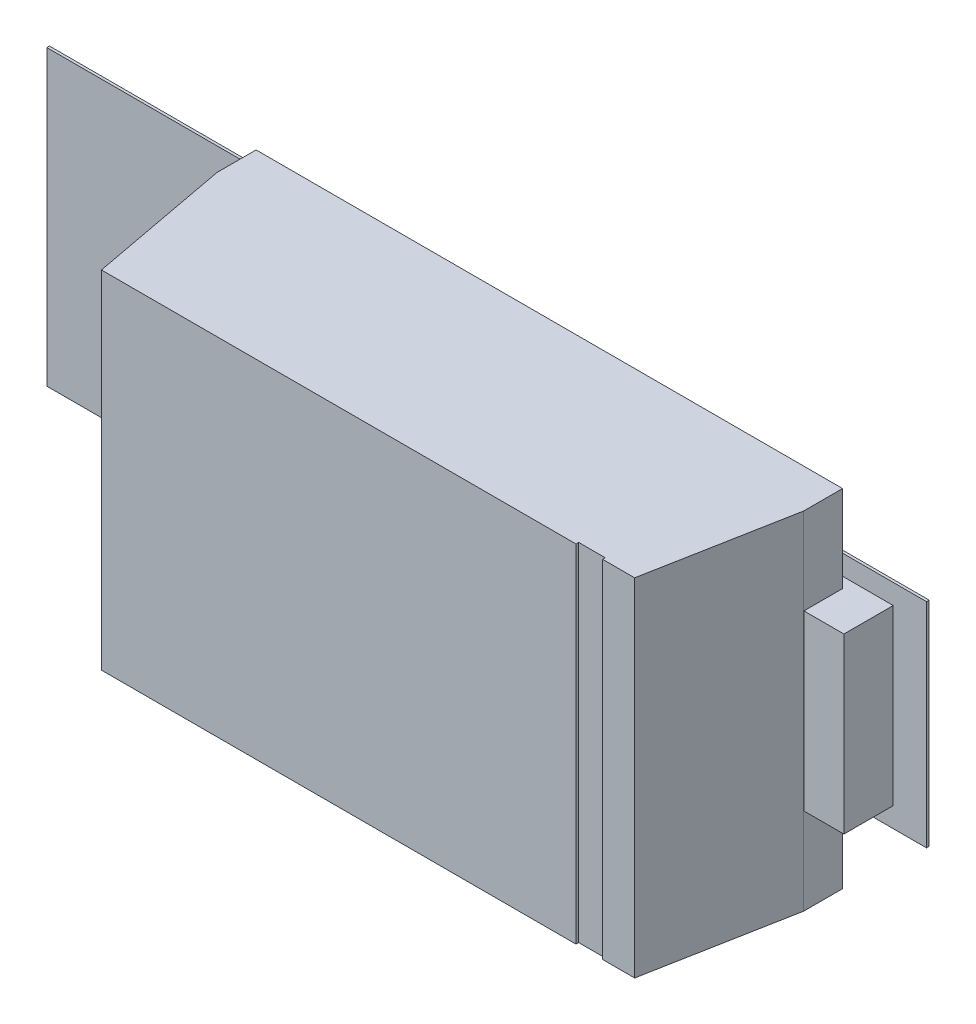
ISO-10303-21;
HEADER;
FILE_DESCRIPTION(('STEP AP214'),'2;1');
FILE_NAME('part.step','',(''),(''),'','','');
FILE_SCHEMA(('AUTOMOTIVE_DESIGN { 1 0 10303 214 1 1 1 1 }'));
ENDSEC;
DATA;
#1=APPLICATION_CONTEXT('core data for automotive mechanical design processes');
#2=APPLICATION_PROTOCOL_DEFINITION('international standard','automotive_design',2000,#1);
#3=PRODUCT_CONTEXT('',#1,'mechanical');
#4=PRODUCT('Part','Part','',(#3));
#5=PRODUCT_RELATED_PRODUCT_CATEGORY('part','',(#4));
#6=PRODUCT_DEFINITION_FORMATION('','',#4);
#7=PRODUCT_DEFINITION_CONTEXT('part definition',#1,'design');
#8=PRODUCT_DEFINITION('design','',#6,#7);
#9=PRODUCT_DEFINITION_SHAPE('','',#8);
#10=(LENGTH_UNIT() NAMED_UNIT(*) SI_UNIT(.MILLI.,.METRE.));
#11=(NAMED_UNIT(*) PLANE_ANGLE_UNIT() SI_UNIT($,.RADIAN.));
#12=(NAMED_UNIT(*) SI_UNIT($,.STERADIAN.) SOLID_ANGLE_UNIT());
#13=UNCERTAINTY_MEASURE_WITH_UNIT(LENGTH_MEASURE(1.E-05),#10,'distance_accuracy_value','');
#14=(GEOMETRIC_REPRESENTATION_CONTEXT(3) GLOBAL_UNCERTAINTY_ASSIGNED_CONTEXT((#13)) GLOBAL_UNIT_ASSIGNED_CONTEXT((#10,
#11,#12)) REPRESENTATION_CONTEXT('',''));
#15=CARTESIAN_POINT('',(0.,0.,0.));
#16=DIRECTION('',(0.,0.,1.));
#17=DIRECTION('',(1.,0.,0.));
#18=AXIS2_PLACEMENT_3D('',#15,#16,#17);
#19=CARTESIAN_POINT('',(-1.1,-0.65,0.2722));
#20=DIRECTION('',(0.982913837182173,0.,-0.184066261644595));
#21=DIRECTION('',(0.,-1.,0.));
#22=AXIS2_PLACEMENT_3D('',#19,#20,#21);
#23=PLANE('',#22);
#24=DIRECTION('',(0.,-1.,0.));
#25=VECTOR('',#24,1.);
#26=CARTESIAN_POINT('',(-1.1,0.65,0.2722));
#27=LINE('',#26,#25);
#28=CARTESIAN_POINT('',(-1.1,0.65,0.2722));
#29=VERTEX_POINT('',#28);
#30=CARTESIAN_POINT('',(-1.1,-0.65,0.2722));
#31=VERTEX_POINT('',#30);
#32=EDGE_CURVE('E440',#29,#31,#27,.T.);
#33=ORIENTED_EDGE('',*,*,#32,.T.);
#34=DIRECTION('',(0.184066261644595,0.,0.982913837182173));
#35=VECTOR('',#34,1.);
#36=CARTESIAN_POINT('',(-1.1,-0.65,0.2722));
#37=LINE('',#36,#35);
#38=CARTESIAN_POINT('',(-1.,-0.65,0.8062));
#39=VERTEX_POINT('',#38);
#40=EDGE_CURVE('E484',#31,#39,#37,.T.);
#41=ORIENTED_EDGE('',*,*,#40,.T.);
#42=DIRECTION('',(0.,1.,0.));
#43=VECTOR('',#42,1.);
#44=CARTESIAN_POINT('',(-1.,-0.65,0.8062));
#45=LINE('',#44,#43);
#46=CARTESIAN_POINT('',(-1.,0.65,0.8062));
#47=VERTEX_POINT('',#46);
#48=EDGE_CURVE('E327',#39,#47,#45,.T.);
#49=ORIENTED_EDGE('',*,*,#48,.T.);
#50=DIRECTION('',(0.184066261644595,0.,0.982913837182173));
#51=VECTOR('',#50,1.);
#52=CARTESIAN_POINT('',(-1.1,0.65,0.2722));
#53=LINE('',#52,#51);
#54=EDGE_CURVE('E322',#29,#47,#53,.T.);
#55=ORIENTED_EDGE('',*,*,#54,.F.);
#56=EDGE_LOOP('',(#33,#41,#49,#55));
#57=FACE_BOUND('',#56,.T.);
#58=ADVANCED_FACE('F17',(#57),#23,.F.);
#59=CARTESIAN_POINT('',(1.25,-0.325,0.0762));
#60=DIRECTION('',(1.,0.,0.));
#61=DIRECTION('',(0.,1.,0.));
#62=AXIS2_PLACEMENT_3D('',#59,#60,#61);
#63=PLANE('',#62);
#64=DIRECTION('',(0.,0.,1.));
#65=VECTOR('',#64,1.);
#66=CARTESIAN_POINT('',(1.25,0.325,0.0862));
#67=LINE('',#66,#65);
#68=CARTESIAN_POINT('',(1.25,0.325,0.0862));
#69=VERTEX_POINT('',#68);
#70=CARTESIAN_POINT('',(1.25,0.325,0.2712));
#71=VERTEX_POINT('',#70);
#72=EDGE_CURVE('E11',#69,#71,#67,.T.);
#73=ORIENTED_EDGE('',*,*,#72,.T.);
#74=DIRECTION('',(0.,1.,0.));
#75=VECTOR('',#74,1.);
#76=CARTESIAN_POINT('',(1.25,-0.325,0.2712));
#77=LINE('',#76,#75);
#78=CARTESIAN_POINT('',(1.25,-0.325,0.2712));
#79=VERTEX_POINT('',#78);
#80=EDGE_CURVE('E347',#79,#71,#77,.T.);
#81=ORIENTED_EDGE('',*,*,#80,.F.);
#82=DIRECTION('',(0.,0.,1.));
#83=VECTOR('',#82,1.);
#84=CARTESIAN_POINT('',(1.25,-0.325,0.0862));
#85=LINE('',#84,#83);
#86=CARTESIAN_POINT('',(1.25,-0.325,0.0862));
#87=VERTEX_POINT('',#86);
#88=EDGE_CURVE('E414',#87,#79,#85,.T.);
#89=ORIENTED_EDGE('',*,*,#88,.F.);
#90=DIRECTION('',(0.,1.,0.));
#91=VECTOR('',#90,1.);
#92=CARTESIAN_POINT('',(1.25,-0.325,0.0862));
#93=LINE('',#92,#91);
#94=EDGE_CURVE('E418',#87,#69,#93,.T.);
#95=ORIENTED_EDGE('',*,*,#94,.T.);
#96=EDGE_LOOP('',(#73,#81,#89,#95));
#97=FACE_BOUND('',#96,.T.);
#98=ADVANCED_FACE('F725',(#97),#63,.T.);
#99=CARTESIAN_POINT('',(1.25,0.325,0.0762));
#100=DIRECTION('',(0.,1.,0.));
#101=DIRECTION('',(1.,0.,0.));
#102=AXIS2_PLACEMENT_3D('',#99,#100,#101);
#103=PLANE('',#102);
#104=DIRECTION('',(0.,0.,1.));
#105=VECTOR('',#104,1.);
#106=CARTESIAN_POINT('',(0.6,0.325,0.0862));
#107=LINE('',#106,#105);
#108=CARTESIAN_POINT('',(0.6,0.325,0.0862));
#109=VERTEX_POINT('',#108);
#110=CARTESIAN_POINT('',(0.6,0.325,0.1262));
#111=VERTEX_POINT('',#110);
#112=EDGE_CURVE('E27',#109,#111,#107,.T.);
#113=ORIENTED_EDGE('',*,*,#112,.T.);
#114=DIRECTION('',(-1.,0.,0.));
#115=VECTOR('',#114,1.);
#116=CARTESIAN_POINT('',(1.1,0.325,0.1262));
#117=LINE('',#116,#115);
#118=CARTESIAN_POINT('',(1.1,0.325,0.1262));
#119=VERTEX_POINT('',#118);
#120=EDGE_CURVE('E294',#119,#111,#117,.T.);
#121=ORIENTED_EDGE('',*,*,#120,.F.);
#122=DIRECTION('',(0.,0.,1.));
#123=VECTOR('',#122,1.);
#124=CARTESIAN_POINT('',(1.1,0.325,0.1262));
#125=LINE('',#124,#123);
#126=CARTESIAN_POINT('',(1.1,0.325,0.2712));
#127=VERTEX_POINT('',#126);
#128=EDGE_CURVE('E384',#119,#127,#125,.T.);
#129=ORIENTED_EDGE('',*,*,#128,.T.);
#130=DIRECTION('',(-1.,0.,0.));
#131=VECTOR('',#130,1.);
#132=CARTESIAN_POINT('',(1.25,0.325,0.2712));
#133=LINE('',#132,#131);
#134=EDGE_CURVE('E435',#71,#127,#133,.T.);
#135=ORIENTED_EDGE('',*,*,#134,.F.);
#136=ORIENTED_EDGE('',*,*,#72,.F.);
#137=DIRECTION('',(-1.,0.,0.));
#138=VECTOR('',#137,1.);
#139=CARTESIAN_POINT('',(1.25,0.325,0.0862));
#140=LINE('',#139,#138);
#141=EDGE_CURVE('E317',#69,#109,#140,.T.);
#142=ORIENTED_EDGE('',*,*,#141,.T.);
#143=EDGE_LOOP('',(#113,#121,#129,#135,#136,#142));
#144=FACE_BOUND('',#143,.T.);
#145=ADVANCED_FACE('F686',(#144),#103,.T.);
#146=CARTESIAN_POINT('',(0.6,0.325,0.0762));
#147=DIRECTION('',(-1.,0.,0.));
#148=DIRECTION('',(0.,0.,1.));
#149=AXIS2_PLACEMENT_3D('',#146,#147,#148);
#150=PLANE('',#149);
#151=DIRECTION('',(0.,0.,1.));
#152=VECTOR('',#151,1.);
#153=CARTESIAN_POINT('',(0.6,-0.325,0.0862));
#154=LINE('',#153,#152);
#155=CARTESIAN_POINT('',(0.6,-0.325,0.0862));
#156=VERTEX_POINT('',#155);
#157=CARTESIAN_POINT('',(0.6,-0.325,0.1262));
#158=VERTEX_POINT('',#157);
#159=EDGE_CURVE('E356',#156,#158,#154,.T.);
#160=ORIENTED_EDGE('',*,*,#159,.T.);
#161=DIRECTION('',(0.,-1.,0.));
#162=VECTOR('',#161,1.);
#163=CARTESIAN_POINT('',(0.6,0.325,0.1262));
#164=LINE('',#163,#162);
#165=EDGE_CURVE('E292',#111,#158,#164,.T.);
#166=ORIENTED_EDGE('',*,*,#165,.F.);
#167=ORIENTED_EDGE('',*,*,#112,.F.);
#168=DIRECTION('',(0.,-1.,0.));
#169=VECTOR('',#168,1.);
#170=CARTESIAN_POINT('',(0.6,0.325,0.0862));
#171=LINE('',#170,#169);
#172=EDGE_CURVE('E179',#109,#156,#171,.T.);
#173=ORIENTED_EDGE('',*,*,#172,.T.);
#174=EDGE_LOOP('',(#160,#166,#167,#173));
#175=FACE_BOUND('',#174,.T.);
#176=ADVANCED_FACE('F747',(#175),#150,.T.);
#177=CARTESIAN_POINT('',(1.1,-0.65,0.1262));
#178=DIRECTION('',(0.,0.,1.));
#179=DIRECTION('',(1.,0.,0.));
#180=AXIS2_PLACEMENT_3D('',#177,#178,#179);
#181=PLANE('',#180);
#182=DIRECTION('',(0.,1.,0.));
#183=VECTOR('',#182,1.);
#184=CARTESIAN_POINT('',(0.05,-0.325,0.1262));
#185=LINE('',#184,#183);
#186=CARTESIAN_POINT('',(0.05,-0.325,0.1262));
#187=VERTEX_POINT('',#186);
#188=CARTESIAN_POINT('',(0.05,0.325,0.1262));
#189=VERTEX_POINT('',#188);
#190=EDGE_CURVE('E408',#187,#189,#185,.T.);
#191=ORIENTED_EDGE('',*,*,#190,.T.);
#192=DIRECTION('',(1.,0.,0.));
#193=VECTOR('',#192,1.);
#194=CARTESIAN_POINT('',(-1.1,0.325,0.1262));
#195=LINE('',#194,#193);
#196=CARTESIAN_POINT('',(-1.1,0.325,0.1262));
#197=VERTEX_POINT('',#196);
#198=EDGE_CURVE('E400',#197,#189,#195,.T.);
#199=ORIENTED_EDGE('',*,*,#198,.F.);
#200=DIRECTION('',(0.,-1.,0.));
#201=VECTOR('',#200,1.);
#202=CARTESIAN_POINT('',(-1.1,0.65,0.1262));
#203=LINE('',#202,#201);
#204=CARTESIAN_POINT('',(-1.1,0.65,0.1262));
#205=VERTEX_POINT('',#204);
#206=EDGE_CURVE('E443',#205,#197,#203,.T.);
#207=ORIENTED_EDGE('',*,*,#206,.F.);
#208=DIRECTION('',(-1.,0.,0.));
#209=VECTOR('',#208,1.);
#210=CARTESIAN_POINT('',(1.1,0.65,0.1262));
#211=LINE('',#210,#209);
#212=CARTESIAN_POINT('',(1.1,0.65,0.1262));
#213=VERTEX_POINT('',#212);
#214=EDGE_CURVE('E499',#213,#205,#211,.T.);
#215=ORIENTED_EDGE('',*,*,#214,.F.);
#216=DIRECTION('',(0.,1.,0.));
#217=VECTOR('',#216,1.);
#218=CARTESIAN_POINT('',(1.1,0.325,0.1262));
#219=LINE('',#218,#217);
#220=EDGE_CURVE('E545',#119,#213,#219,.T.);
#221=ORIENTED_EDGE('',*,*,#220,.F.);
#222=ORIENTED_EDGE('',*,*,#120,.T.);
#223=ORIENTED_EDGE('',*,*,#165,.T.);
#224=DIRECTION('',(-1.,0.,0.));
#225=VECTOR('',#224,1.);
#226=CARTESIAN_POINT('',(1.1,-0.325,0.1262));
#227=LINE('',#226,#225);
#228=CARTESIAN_POINT('',(1.1,-0.325,0.1262));
#229=VERTEX_POINT('',#228);
#230=EDGE_CURVE('E352',#229,#158,#227,.T.);
#231=ORIENTED_EDGE('',*,*,#230,.F.);
#232=DIRECTION('',(0.,1.,0.));
#233=VECTOR('',#232,1.);
#234=CARTESIAN_POINT('',(1.1,-0.65,0.1262));
#235=LINE('',#234,#233);
#236=CARTESIAN_POINT('',(1.1,-0.65,0.1262));
#237=VERTEX_POINT('',#236);
#238=EDGE_CURVE('E415',#237,#229,#235,.T.);
#239=ORIENTED_EDGE('',*,*,#238,.F.);
#240=DIRECTION('',(1.,0.,0.));
#241=VECTOR('',#240,1.);
#242=CARTESIAN_POINT('',(-1.1,-0.65,0.1262));
#243=LINE('',#242,#241);
#244=CARTESIAN_POINT('',(-1.1,-0.65,0.1262));
#245=VERTEX_POINT('',#244);
#246=EDGE_CURVE('E426',#245,#237,#243,.T.);
#247=ORIENTED_EDGE('',*,*,#246,.F.);
#248=DIRECTION('',(0.,-1.,0.));
#249=VECTOR('',#248,1.);
#250=CARTESIAN_POINT('',(-1.1,-0.325,0.1262));
#251=LINE('',#250,#249);
#252=CARTESIAN_POINT('',(-1.1,-0.325,0.1262));
#253=VERTEX_POINT('',#252);
#254=EDGE_CURVE('E439',#253,#245,#251,.T.);
#255=ORIENTED_EDGE('',*,*,#254,.F.);
#256=DIRECTION('',(1.,0.,0.));
#257=VECTOR('',#256,1.);
#258=CARTESIAN_POINT('',(-1.1,-0.325,0.1262));
#259=LINE('',#258,#257);
#260=EDGE_CURVE('E374',#253,#187,#259,.T.);
#261=ORIENTED_EDGE('',*,*,#260,.T.);
#262=EDGE_LOOP('',(#191,#199,#207,#215,#221,#222,#223,#231,#239,#247,#255,#261));
#263=FACE_BOUND('',#262,.T.);
#264=ADVANCED_FACE('F669',(#263),#181,.F.);
#265=CARTESIAN_POINT('',(-1.1,0.65,0.0762));
#266=DIRECTION('',(-1.,0.,0.));
#267=DIRECTION('',(0.,0.,1.));
#268=AXIS2_PLACEMENT_3D('',#265,#266,#267);
#269=PLANE('',#268);
#270=ORIENTED_EDGE('',*,*,#254,.T.);
#271=DIRECTION('',(0.,0.,1.));
#272=VECTOR('',#271,1.);
#273=CARTESIAN_POINT('',(-1.1,-0.65,0.1262));
#274=LINE('',#273,#272);
#275=EDGE_CURVE('E431',#245,#31,#274,.T.);
#276=ORIENTED_EDGE('',*,*,#275,.T.);
#277=ORIENTED_EDGE('',*,*,#32,.F.);
#278=DIRECTION('',(0.,0.,1.));
#279=VECTOR('',#278,1.);
#280=CARTESIAN_POINT('',(-1.1,0.65,0.1262));
#281=LINE('',#280,#279);
#282=EDGE_CURVE('E446',#205,#29,#281,.T.);
#283=ORIENTED_EDGE('',*,*,#282,.F.);
#284=ORIENTED_EDGE('',*,*,#206,.T.);
#285=DIRECTION('',(0.,0.,1.));
#286=VECTOR('',#285,1.);
#287=CARTESIAN_POINT('',(-1.1,0.325,0.1262));
#288=LINE('',#287,#286);
#289=CARTESIAN_POINT('',(-1.1,0.325,0.2712));
#290=VERTEX_POINT('',#289);
#291=EDGE_CURVE('E405',#197,#290,#288,.T.);
#292=ORIENTED_EDGE('',*,*,#291,.T.);
#293=DIRECTION('',(0.,1.,0.));
#294=VECTOR('',#293,1.);
#295=CARTESIAN_POINT('',(-1.1,-0.325,0.2712));
#296=LINE('',#295,#294);
#297=CARTESIAN_POINT('',(-1.1,-0.325,0.2712));
#298=VERTEX_POINT('',#297);
#299=EDGE_CURVE('E344',#298,#290,#296,.T.);
#300=ORIENTED_EDGE('',*,*,#299,.F.);
#301=DIRECTION('',(0.,0.,1.));
#302=VECTOR('',#301,1.);
#303=CARTESIAN_POINT('',(-1.1,-0.325,0.1262));
#304=LINE('',#303,#302);
#305=EDGE_CURVE('E378',#253,#298,#304,.T.);
#306=ORIENTED_EDGE('',*,*,#305,.F.);
#307=EDGE_LOOP('',(#270,#276,#277,#283,#284,#292,#300,#306));
#308=FACE_BOUND('',#307,.T.);
#309=ADVANCED_FACE('F696',(#308),#269,.T.);
#310=CARTESIAN_POINT('',(0.,0.,0.2712));
#311=DIRECTION('',(0.,0.,1.));
#312=DIRECTION('',(1.,0.,0.));
#313=AXIS2_PLACEMENT_3D('',#310,#311,#312);
#314=PLANE('',#313);
#315=ORIENTED_EDGE('',*,*,#80,.T.);
#316=ORIENTED_EDGE('',*,*,#134,.T.);
#317=DIRECTION('',(0.,1.,0.));
#318=VECTOR('',#317,1.);
#319=CARTESIAN_POINT('',(1.1,-0.325,0.2712));
#320=LINE('',#319,#318);
#321=CARTESIAN_POINT('',(1.1,-0.325,0.2712));
#322=VERTEX_POINT('',#321);
#323=EDGE_CURVE('E380',#322,#127,#320,.T.);
#324=ORIENTED_EDGE('',*,*,#323,.F.);
#325=DIRECTION('',(1.,0.,0.));
#326=VECTOR('',#325,1.);
#327=CARTESIAN_POINT('',(1.1,-0.325,0.2712));
#328=LINE('',#327,#326);
#329=EDGE_CURVE('E357',#322,#79,#328,.T.);
#330=ORIENTED_EDGE('',*,*,#329,.T.);
#331=EDGE_LOOP('',(#315,#316,#324,#330));
#332=FACE_BOUND('',#331,.T.);
#333=ADVANCED_FACE('F678',(#332),#314,.T.);
#334=CARTESIAN_POINT('',(0.,0.,0.2712));
#335=DIRECTION('',(0.,0.,1.));
#336=DIRECTION('',(1.,0.,0.));
#337=AXIS2_PLACEMENT_3D('',#334,#335,#336);
#338=PLANE('',#337);
#339=ORIENTED_EDGE('',*,*,#299,.T.);
#340=DIRECTION('',(-1.,0.,0.));
#341=VECTOR('',#340,1.);
#342=CARTESIAN_POINT('',(-1.1,0.325,0.2712));
#343=LINE('',#342,#341);
#344=CARTESIAN_POINT('',(-1.25,0.325,0.2712));
#345=VERTEX_POINT('',#344);
#346=EDGE_CURVE('E290',#290,#345,#343,.T.);
#347=ORIENTED_EDGE('',*,*,#346,.T.);
#348=DIRECTION('',(0.,-1.,0.));
#349=VECTOR('',#348,1.);
#350=CARTESIAN_POINT('',(-1.25,0.325,0.2712));
#351=LINE('',#350,#349);
#352=CARTESIAN_POINT('',(-1.25,-0.325,0.2712));
#353=VERTEX_POINT('',#352);
#354=EDGE_CURVE('E358',#345,#353,#351,.T.);
#355=ORIENTED_EDGE('',*,*,#354,.T.);
#356=DIRECTION('',(1.,0.,0.));
#357=VECTOR('',#356,1.);
#358=CARTESIAN_POINT('',(-1.25,-0.325,0.2712));
#359=LINE('',#358,#357);
#360=EDGE_CURVE('E348',#353,#298,#359,.T.);
#361=ORIENTED_EDGE('',*,*,#360,.T.);
#362=EDGE_LOOP('',(#339,#347,#355,#361));
#363=FACE_BOUND('',#362,.T.);
#364=ADVANCED_FACE('F735',(#363),#338,.T.);
#365=CARTESIAN_POINT('',(-1.25,-0.325,0.0762));
#366=DIRECTION('',(0.,-1.,0.));
#367=DIRECTION('',(0.,0.,-1.));
#368=AXIS2_PLACEMENT_3D('',#365,#366,#367);
#369=PLANE('',#368);
#370=DIRECTION('',(0.,0.,1.));
#371=VECTOR('',#370,1.);
#372=CARTESIAN_POINT('',(0.05,-0.325,0.0862));
#373=LINE('',#372,#371);
#374=CARTESIAN_POINT('',(0.05,-0.325,0.0862));
#375=VERTEX_POINT('',#374);
#376=EDGE_CURVE('E379',#375,#187,#373,.T.);
#377=ORIENTED_EDGE('',*,*,#376,.T.);
#378=ORIENTED_EDGE('',*,*,#260,.F.);
#379=ORIENTED_EDGE('',*,*,#305,.T.);
#380=ORIENTED_EDGE('',*,*,#360,.F.);
#381=DIRECTION('',(0.,0.,1.));
#382=VECTOR('',#381,1.);
#383=CARTESIAN_POINT('',(-1.25,-0.325,0.0862));
#384=LINE('',#383,#382);
#385=CARTESIAN_POINT('',(-1.25,-0.325,0.0862));
#386=VERTEX_POINT('',#385);
#387=EDGE_CURVE('E363',#386,#353,#384,.T.);
#388=ORIENTED_EDGE('',*,*,#387,.F.);
#389=DIRECTION('',(1.,0.,0.));
#390=VECTOR('',#389,1.);
#391=CARTESIAN_POINT('',(-1.25,-0.325,0.0862));
#392=LINE('',#391,#390);
#393=EDGE_CURVE('E338',#386,#375,#392,.T.);
#394=ORIENTED_EDGE('',*,*,#393,.T.);
#395=EDGE_LOOP('',(#377,#378,#379,#380,#388,#394));
#396=FACE_BOUND('',#395,.T.);
#397=ADVANCED_FACE('F704',(#396),#369,.T.);
#398=CARTESIAN_POINT('',(0.05,-0.325,0.0762));
#399=DIRECTION('',(1.,0.,0.));
#400=DIRECTION('',(0.,1.,0.));
#401=AXIS2_PLACEMENT_3D('',#398,#399,#400);
#402=PLANE('',#401);
#403=DIRECTION('',(0.,0.,1.));
#404=VECTOR('',#403,1.);
#405=CARTESIAN_POINT('',(0.05,0.325,0.0862));
#406=LINE('',#405,#404);
#407=CARTESIAN_POINT('',(0.05,0.325,0.0862));
#408=VERTEX_POINT('',#407);
#409=EDGE_CURVE('E404',#408,#189,#406,.T.);
#410=ORIENTED_EDGE('',*,*,#409,.T.);
#411=ORIENTED_EDGE('',*,*,#190,.F.);
#412=ORIENTED_EDGE('',*,*,#376,.F.);
#413=DIRECTION('',(0.,1.,0.));
#414=VECTOR('',#413,1.);
#415=CARTESIAN_POINT('',(0.05,-0.325,0.0862));
#416=LINE('',#415,#414);
#417=EDGE_CURVE('E334',#375,#408,#416,.T.);
#418=ORIENTED_EDGE('',*,*,#417,.T.);
#419=EDGE_LOOP('',(#410,#411,#412,#418));
#420=FACE_BOUND('',#419,.T.);
#421=ADVANCED_FACE('F708',(#420),#402,.T.);
#422=CARTESIAN_POINT('',(0.05,0.325,0.0762));
#423=DIRECTION('',(0.,1.,0.));
#424=DIRECTION('',(1.,0.,0.));
#425=AXIS2_PLACEMENT_3D('',#422,#423,#424);
#426=PLANE('',#425);
#427=DIRECTION('',(0.,0.,1.));
#428=VECTOR('',#427,1.);
#429=CARTESIAN_POINT('',(-1.25,0.325,0.0862));
#430=LINE('',#429,#428);
#431=CARTESIAN_POINT('',(-1.25,0.325,0.0862));
#432=VERTEX_POINT('',#431);
#433=EDGE_CURVE('E362',#432,#345,#430,.T.);
#434=ORIENTED_EDGE('',*,*,#433,.T.);
#435=ORIENTED_EDGE('',*,*,#346,.F.);
#436=ORIENTED_EDGE('',*,*,#291,.F.);
#437=ORIENTED_EDGE('',*,*,#198,.T.);
#438=ORIENTED_EDGE('',*,*,#409,.F.);
#439=DIRECTION('',(-1.,0.,0.));
#440=VECTOR('',#439,1.);
#441=CARTESIAN_POINT('',(0.05,0.325,0.0862));
#442=LINE('',#441,#440);
#443=EDGE_CURVE('E339',#408,#432,#442,.T.);
#444=ORIENTED_EDGE('',*,*,#443,.T.);
#445=EDGE_LOOP('',(#434,#435,#436,#437,#438,#444));
#446=FACE_BOUND('',#445,.T.);
#447=ADVANCED_FACE('F710',(#446),#426,.T.);
#448=CARTESIAN_POINT('',(-1.25,0.325,0.0762));
#449=DIRECTION('',(-1.,0.,0.));
#450=DIRECTION('',(0.,0.,1.));
#451=AXIS2_PLACEMENT_3D('',#448,#449,#450);
#452=PLANE('',#451);
#453=ORIENTED_EDGE('',*,*,#387,.T.);
#454=ORIENTED_EDGE('',*,*,#354,.F.);
#455=ORIENTED_EDGE('',*,*,#433,.F.);
#456=DIRECTION('',(0.,-1.,0.));
#457=VECTOR('',#456,1.);
#458=CARTESIAN_POINT('',(-1.25,0.325,0.0862));
#459=LINE('',#458,#457);
#460=EDGE_CURVE('E373',#432,#386,#459,.T.);
#461=ORIENTED_EDGE('',*,*,#460,.T.);
#462=EDGE_LOOP('',(#453,#454,#455,#461));
#463=FACE_BOUND('',#462,.T.);
#464=ADVANCED_FACE('F712',(#463),#452,.T.);
#465=CARTESIAN_POINT('',(1.375,0.4,0.0762));
#466=DIRECTION('',(0.,1.,0.));
#467=DIRECTION('',(1.,0.,0.));
#468=AXIS2_PLACEMENT_3D('',#465,#466,#467);
#469=PLANE('',#468);
#470=DIRECTION('',(0.,0.,1.));
#471=VECTOR('',#470,1.);
#472=CARTESIAN_POINT('',(0.575,0.4,0.0762));
#473=LINE('',#472,#471);
#474=CARTESIAN_POINT('',(0.575,0.4,0.0762));
#475=VERTEX_POINT('',#474);
#476=CARTESIAN_POINT('',(0.575,0.4,0.0862));
#477=VERTEX_POINT('',#476);
#478=EDGE_CURVE('E298',#475,#477,#473,.T.);
#479=ORIENTED_EDGE('',*,*,#478,.T.);
#480=DIRECTION('',(-1.,0.,0.));
#481=VECTOR('',#480,1.);
#482=CARTESIAN_POINT('',(1.375,0.4,0.0862));
#483=LINE('',#482,#481);
#484=CARTESIAN_POINT('',(1.375,0.4,0.0862));
#485=VERTEX_POINT('',#484);
#486=EDGE_CURVE('E318',#485,#477,#483,.T.);
#487=ORIENTED_EDGE('',*,*,#486,.F.);
#488=DIRECTION('',(0.,0.,1.));
#489=VECTOR('',#488,1.);
#490=CARTESIAN_POINT('',(1.375,0.4,0.0762));
#491=LINE('',#490,#489);
#492=CARTESIAN_POINT('',(1.375,0.4,0.0762));
#493=VERTEX_POINT('',#492);
#494=EDGE_CURVE('E481',#493,#485,#491,.T.);
#495=ORIENTED_EDGE('',*,*,#494,.F.);
#496=DIRECTION('',(-1.,0.,0.));
#497=VECTOR('',#496,1.);
#498=CARTESIAN_POINT('',(1.375,0.4,0.0762));
#499=LINE('',#498,#497);
#500=EDGE_CURVE('E273',#493,#475,#499,.T.);
#501=ORIENTED_EDGE('',*,*,#500,.T.);
#502=EDGE_LOOP('',(#479,#487,#495,#501));
#503=FACE_BOUND('',#502,.T.);
#504=ADVANCED_FACE('F719',(#503),#469,.T.);
#505=CARTESIAN_POINT('',(1.375,-0.4,0.0762));
#506=DIRECTION('',(1.,0.,0.));
#507=DIRECTION('',(0.,1.,0.));
#508=AXIS2_PLACEMENT_3D('',#505,#506,#507);
#509=PLANE('',#508);
#510=ORIENTED_EDGE('',*,*,#494,.T.);
#511=DIRECTION('',(0.,1.,0.));
#512=VECTOR('',#511,1.);
#513=CARTESIAN_POINT('',(1.375,-0.4,0.0862));
#514=LINE('',#513,#512);
#515=CARTESIAN_POINT('',(1.375,-0.4,0.0862));
#516=VERTEX_POINT('',#515);
#517=EDGE_CURVE('E494',#516,#485,#514,.T.);
#518=ORIENTED_EDGE('',*,*,#517,.F.);
#519=DIRECTION('',(0.,0.,1.));
#520=VECTOR('',#519,1.);
#521=CARTESIAN_POINT('',(1.375,-0.4,0.0762));
#522=LINE('',#521,#520);
#523=CARTESIAN_POINT('',(1.375,-0.4,0.0762));
#524=VERTEX_POINT('',#523);
#525=EDGE_CURVE('E452',#524,#516,#522,.T.);
#526=ORIENTED_EDGE('',*,*,#525,.F.);
#527=DIRECTION('',(0.,1.,0.));
#528=VECTOR('',#527,1.);
#529=CARTESIAN_POINT('',(1.375,-0.4,0.0762));
#530=LINE('',#529,#528);
#531=EDGE_CURVE('E351',#524,#493,#530,.T.);
#532=ORIENTED_EDGE('',*,*,#531,.T.);
#533=EDGE_LOOP('',(#510,#518,#526,#532));
#534=FACE_BOUND('',#533,.T.);
#535=ADVANCED_FACE('F569',(#534),#509,.T.);
#536=CARTESIAN_POINT('',(0.575,-0.4,0.0762));
#537=DIRECTION('',(0.,-1.,0.));
#538=DIRECTION('',(0.,0.,-1.));
#539=AXIS2_PLACEMENT_3D('',#536,#537,#538);
#540=PLANE('',#539);
#541=ORIENTED_EDGE('',*,*,#525,.T.);
#542=DIRECTION('',(1.,0.,0.));
#543=VECTOR('',#542,1.);
#544=CARTESIAN_POINT('',(0.575,-0.4,0.0862));
#545=LINE('',#544,#543);
#546=CARTESIAN_POINT('',(0.575,-0.4,0.0862));
#547=VERTEX_POINT('',#546);
#548=EDGE_CURVE('E490',#547,#516,#545,.T.);
#549=ORIENTED_EDGE('',*,*,#548,.F.);
#550=DIRECTION('',(0.,0.,1.));
#551=VECTOR('',#550,1.);
#552=CARTESIAN_POINT('',(0.575,-0.4,0.0762));
#553=LINE('',#552,#551);
#554=CARTESIAN_POINT('',(0.575,-0.4,0.0762));
#555=VERTEX_POINT('',#554);
#556=EDGE_CURVE('E191',#555,#547,#553,.T.);
#557=ORIENTED_EDGE('',*,*,#556,.F.);
#558=DIRECTION('',(1.,0.,0.));
#559=VECTOR('',#558,1.);
#560=CARTESIAN_POINT('',(0.575,-0.4,0.0762));
#561=LINE('',#560,#559);
#562=EDGE_CURVE('E264',#555,#524,#561,.T.);
#563=ORIENTED_EDGE('',*,*,#562,.T.);
#564=EDGE_LOOP('',(#541,#549,#557,#563));
#565=FACE_BOUND('',#564,.T.);
#566=ADVANCED_FACE('F564',(#565),#540,.T.);
#567=CARTESIAN_POINT('',(-1.925,0.55,0.0762));
#568=DIRECTION('',(-1.,0.,0.));
#569=DIRECTION('',(0.,0.,1.));
#570=AXIS2_PLACEMENT_3D('',#567,#568,#569);
#571=PLANE('',#570);
#572=DIRECTION('',(0.,0.,1.));
#573=VECTOR('',#572,1.);
#574=CARTESIAN_POINT('',(-1.925,-0.55,0.0762));
#575=LINE('',#574,#573);
#576=CARTESIAN_POINT('',(-1.925,-0.55,0.0762));
#577=VERTEX_POINT('',#576);
#578=CARTESIAN_POINT('',(-1.925,-0.55,0.0862));
#579=VERTEX_POINT('',#578);
#580=EDGE_CURVE('E450',#577,#579,#575,.T.);
#581=ORIENTED_EDGE('',*,*,#580,.T.);
#582=DIRECTION('',(0.,-1.,0.));
#583=VECTOR('',#582,1.);
#584=CARTESIAN_POINT('',(-1.925,0.55,0.0862));
#585=LINE('',#584,#583);
#586=CARTESIAN_POINT('',(-1.925,0.55,0.0862));
#587=VERTEX_POINT('',#586);
#588=EDGE_CURVE('E258',#587,#579,#585,.T.);
#589=ORIENTED_EDGE('',*,*,#588,.F.);
#590=DIRECTION('',(0.,0.,1.));
#591=VECTOR('',#590,1.);
#592=CARTESIAN_POINT('',(-1.925,0.55,0.0762));
#593=LINE('',#592,#591);
#594=CARTESIAN_POINT('',(-1.925,0.55,0.0762));
#595=VERTEX_POINT('',#594);
#596=EDGE_CURVE('E251',#595,#587,#593,.T.);
#597=ORIENTED_EDGE('',*,*,#596,.F.);
#598=DIRECTION('',(0.,-1.,0.));
#599=VECTOR('',#598,1.);
#600=CARTESIAN_POINT('',(-1.925,0.55,0.0762));
#601=LINE('',#600,#599);
#602=EDGE_CURVE('E255',#595,#577,#601,.T.);
#603=ORIENTED_EDGE('',*,*,#602,.T.);
#604=EDGE_LOOP('',(#581,#589,#597,#603));
#605=FACE_BOUND('',#604,.T.);
#606=ADVANCED_FACE('F253',(#605),#571,.T.);
#607=CARTESIAN_POINT('',(-1.925,-0.55,0.0762));
#608=DIRECTION('',(0.,-1.,0.));
#609=DIRECTION('',(0.,0.,-1.));
#610=AXIS2_PLACEMENT_3D('',#607,#608,#609);
#611=PLANE('',#610);
#612=DIRECTION('',(0.,0.,1.));
#613=VECTOR('',#612,1.);
#614=CARTESIAN_POINT('',(0.075,-0.55,0.0762));
#615=LINE('',#614,#613);
#616=CARTESIAN_POINT('',(0.075,-0.55,0.0762));
#617=VERTEX_POINT('',#616);
#618=CARTESIAN_POINT('',(0.075,-0.55,0.0862));
#619=VERTEX_POINT('',#618);
#620=EDGE_CURVE('E366',#617,#619,#615,.T.);
#621=ORIENTED_EDGE('',*,*,#620,.T.);
#622=DIRECTION('',(1.,0.,0.));
#623=VECTOR('',#622,1.);
#624=CARTESIAN_POINT('',(-1.925,-0.55,0.0862));
#625=LINE('',#624,#623);
#626=EDGE_CURVE('E307',#579,#619,#625,.T.);
#627=ORIENTED_EDGE('',*,*,#626,.F.);
#628=ORIENTED_EDGE('',*,*,#580,.F.);
#629=DIRECTION('',(1.,0.,0.));
#630=VECTOR('',#629,1.);
#631=CARTESIAN_POINT('',(-1.925,-0.55,0.0762));
#632=LINE('',#631,#630);
#633=EDGE_CURVE('E277',#577,#617,#632,.T.);
#634=ORIENTED_EDGE('',*,*,#633,.T.);
#635=EDGE_LOOP('',(#621,#627,#628,#634));
#636=FACE_BOUND('',#635,.T.);
#637=ADVANCED_FACE('F774',(#636),#611,.T.);
#638=CARTESIAN_POINT('',(0.075,-0.55,0.0762));
#639=DIRECTION('',(1.,0.,0.));
#640=DIRECTION('',(0.,1.,0.));
#641=AXIS2_PLACEMENT_3D('',#638,#639,#640);
#642=PLANE('',#641);
#643=DIRECTION('',(0.,0.,1.));
#644=VECTOR('',#643,1.);
#645=CARTESIAN_POINT('',(0.075,0.55,0.0762));
#646=LINE('',#645,#644);
#647=CARTESIAN_POINT('',(0.075,0.55,0.0762));
#648=VERTEX_POINT('',#647);
#649=CARTESIAN_POINT('',(0.075,0.55,0.0862));
#650=VERTEX_POINT('',#649);
#651=EDGE_CURVE('E263',#648,#650,#646,.T.);
#652=ORIENTED_EDGE('',*,*,#651,.T.);
#653=DIRECTION('',(0.,1.,0.));
#654=VECTOR('',#653,1.);
#655=CARTESIAN_POINT('',(0.075,-0.55,0.0862));
#656=LINE('',#655,#654);
#657=EDGE_CURVE('E370',#619,#650,#656,.T.);
#658=ORIENTED_EDGE('',*,*,#657,.F.);
#659=ORIENTED_EDGE('',*,*,#620,.F.);
#660=DIRECTION('',(0.,1.,0.));
#661=VECTOR('',#660,1.);
#662=CARTESIAN_POINT('',(0.075,-0.55,0.0762));
#663=LINE('',#662,#661);
#664=EDGE_CURVE('E286',#617,#648,#663,.T.);
#665=ORIENTED_EDGE('',*,*,#664,.T.);
#666=EDGE_LOOP('',(#652,#658,#659,#665));
#667=FACE_BOUND('',#666,.T.);
#668=ADVANCED_FACE('F776',(#667),#642,.T.);
#669=CARTESIAN_POINT('',(0.075,0.55,0.0762));
#670=DIRECTION('',(0.,1.,0.));
#671=DIRECTION('',(1.,0.,0.));
#672=AXIS2_PLACEMENT_3D('',#669,#670,#671);
#673=PLANE('',#672);
#674=ORIENTED_EDGE('',*,*,#596,.T.);
#675=DIRECTION('',(-1.,0.,0.));
#676=VECTOR('',#675,1.);
#677=CARTESIAN_POINT('',(0.075,0.55,0.0862));
#678=LINE('',#677,#676);
#679=EDGE_CURVE('E367',#650,#587,#678,.T.);
#680=ORIENTED_EDGE('',*,*,#679,.F.);
#681=ORIENTED_EDGE('',*,*,#651,.F.);
#682=DIRECTION('',(-1.,0.,0.));
#683=VECTOR('',#682,1.);
#684=CARTESIAN_POINT('',(0.075,0.55,0.0762));
#685=LINE('',#684,#683);
#686=EDGE_CURVE('E267',#648,#595,#685,.T.);
#687=ORIENTED_EDGE('',*,*,#686,.T.);
#688=EDGE_LOOP('',(#674,#680,#681,#687));
#689=FACE_BOUND('',#688,.T.);
#690=ADVANCED_FACE('F268',(#689),#673,.T.);
#691=CARTESIAN_POINT('',(0.,0.,0.0762));
#692=DIRECTION('',(0.,0.,1.));
#693=DIRECTION('',(1.,0.,0.));
#694=AXIS2_PLACEMENT_3D('',#691,#692,#693);
#695=PLANE('',#694);
#696=ORIENTED_EDGE('',*,*,#500,.F.);
#697=ORIENTED_EDGE('',*,*,#531,.F.);
#698=ORIENTED_EDGE('',*,*,#562,.F.);
#699=DIRECTION('',(0.,-1.,0.));
#700=VECTOR('',#699,1.);
#701=CARTESIAN_POINT('',(0.575,0.4,0.0762));
#702=LINE('',#701,#700);
#703=EDGE_CURVE('E295',#475,#555,#702,.T.);
#704=ORIENTED_EDGE('',*,*,#703,.F.);
#705=EDGE_LOOP('',(#696,#697,#698,#704));
#706=FACE_BOUND('',#705,.T.);
#707=ADVANCED_FACE('F795',(#706),#695,.F.);
#708=CARTESIAN_POINT('',(0.,0.,0.0762));
#709=DIRECTION('',(0.,0.,1.));
#710=DIRECTION('',(1.,0.,0.));
#711=AXIS2_PLACEMENT_3D('',#708,#709,#710);
#712=PLANE('',#711);
#713=ORIENTED_EDGE('',*,*,#664,.F.);
#714=ORIENTED_EDGE('',*,*,#633,.F.);
#715=ORIENTED_EDGE('',*,*,#602,.F.);
#716=ORIENTED_EDGE('',*,*,#686,.F.);
#717=EDGE_LOOP('',(#713,#714,#715,#716));
#718=FACE_BOUND('',#717,.T.);
#719=ADVANCED_FACE('F275',(#718),#712,.F.);
#720=CARTESIAN_POINT('',(0.575,0.4,0.0762));
#721=DIRECTION('',(-1.,0.,0.));
#722=DIRECTION('',(0.,0.,1.));
#723=AXIS2_PLACEMENT_3D('',#720,#721,#722);
#724=PLANE('',#723);
#725=ORIENTED_EDGE('',*,*,#556,.T.);
#726=DIRECTION('',(0.,-1.,0.));
#727=VECTOR('',#726,1.);
#728=CARTESIAN_POINT('',(0.575,0.4,0.0862));
#729=LINE('',#728,#727);
#730=EDGE_CURVE('E314',#477,#547,#729,.T.);
#731=ORIENTED_EDGE('',*,*,#730,.F.);
#732=ORIENTED_EDGE('',*,*,#478,.F.);
#733=ORIENTED_EDGE('',*,*,#703,.T.);
#734=EDGE_LOOP('',(#725,#731,#732,#733));
#735=FACE_BOUND('',#734,.T.);
#736=ADVANCED_FACE('F576',(#735),#724,.T.);
#737=CARTESIAN_POINT('',(0.,0.,0.0862));
#738=DIRECTION('',(0.,0.,1.));
#739=DIRECTION('',(1.,0.,0.));
#740=AXIS2_PLACEMENT_3D('',#737,#738,#739);
#741=PLANE('',#740);
#742=ORIENTED_EDGE('',*,*,#443,.F.);
#743=ORIENTED_EDGE('',*,*,#417,.F.);
#744=ORIENTED_EDGE('',*,*,#393,.F.);
#745=ORIENTED_EDGE('',*,*,#460,.F.);
#746=EDGE_LOOP('',(#742,#743,#744,#745));
#747=FACE_BOUND('',#746,.T.);
#748=ORIENTED_EDGE('',*,*,#588,.T.);
#749=ORIENTED_EDGE('',*,*,#626,.T.);
#750=ORIENTED_EDGE('',*,*,#657,.T.);
#751=ORIENTED_EDGE('',*,*,#679,.T.);
#752=EDGE_LOOP('',(#748,#749,#750,#751));
#753=FACE_BOUND('',#752,.T.);
#754=ADVANCED_FACE('F767',(#747,#753),#741,.T.);
#755=CARTESIAN_POINT('',(0.,0.,0.0862));
#756=DIRECTION('',(0.,0.,1.));
#757=DIRECTION('',(1.,0.,0.));
#758=AXIS2_PLACEMENT_3D('',#755,#756,#757);
#759=PLANE('',#758);
#760=ORIENTED_EDGE('',*,*,#141,.F.);
#761=ORIENTED_EDGE('',*,*,#94,.F.);
#762=DIRECTION('',(1.,0.,0.));
#763=VECTOR('',#762,1.);
#764=CARTESIAN_POINT('',(0.6,-0.325,0.0862));
#765=LINE('',#764,#763);
#766=EDGE_CURVE('E495',#156,#87,#765,.T.);
#767=ORIENTED_EDGE('',*,*,#766,.F.);
#768=ORIENTED_EDGE('',*,*,#172,.F.);
#769=EDGE_LOOP('',(#760,#761,#767,#768));
#770=FACE_BOUND('',#769,.T.);
#771=ORIENTED_EDGE('',*,*,#548,.T.);
#772=ORIENTED_EDGE('',*,*,#517,.T.);
#773=ORIENTED_EDGE('',*,*,#486,.T.);
#774=ORIENTED_EDGE('',*,*,#730,.T.);
#775=EDGE_LOOP('',(#771,#772,#773,#774));
#776=FACE_BOUND('',#775,.T.);
#777=ADVANCED_FACE('F574',(#770,#776),#759,.T.);
#778=CARTESIAN_POINT('',(0.6,-0.325,0.0762));
#779=DIRECTION('',(0.,-1.,0.));
#780=DIRECTION('',(0.,0.,-1.));
#781=AXIS2_PLACEMENT_3D('',#778,#779,#780);
#782=PLANE('',#781);
#783=ORIENTED_EDGE('',*,*,#88,.T.);
#784=ORIENTED_EDGE('',*,*,#329,.F.);
#785=DIRECTION('',(0.,0.,1.));
#786=VECTOR('',#785,1.);
#787=CARTESIAN_POINT('',(1.1,-0.325,0.1262));
#788=LINE('',#787,#786);
#789=EDGE_CURVE('E410',#229,#322,#788,.T.);
#790=ORIENTED_EDGE('',*,*,#789,.F.);
#791=ORIENTED_EDGE('',*,*,#230,.T.);
#792=ORIENTED_EDGE('',*,*,#159,.F.);
#793=ORIENTED_EDGE('',*,*,#766,.T.);
#794=EDGE_LOOP('',(#783,#784,#790,#791,#792,#793));
#795=FACE_BOUND('',#794,.T.);
#796=ADVANCED_FACE('F673',(#795),#782,.T.);
#797=CARTESIAN_POINT('',(1.1,-0.65,0.0762));
#798=DIRECTION('',(1.,0.,0.));
#799=DIRECTION('',(0.,1.,0.));
#800=AXIS2_PLACEMENT_3D('',#797,#798,#799);
#801=PLANE('',#800);
#802=ORIENTED_EDGE('',*,*,#323,.T.);
#803=ORIENTED_EDGE('',*,*,#128,.F.);
#804=ORIENTED_EDGE('',*,*,#220,.T.);
#805=DIRECTION('',(0.,0.,1.));
#806=VECTOR('',#805,1.);
#807=CARTESIAN_POINT('',(1.1,0.65,0.1262));
#808=LINE('',#807,#806);
#809=CARTESIAN_POINT('',(1.1,0.65,0.2722));
#810=VERTEX_POINT('',#809);
#811=EDGE_CURVE('E393',#213,#810,#808,.T.);
#812=ORIENTED_EDGE('',*,*,#811,.T.);
#813=DIRECTION('',(0.,1.,0.));
#814=VECTOR('',#813,1.);
#815=CARTESIAN_POINT('',(1.1,-0.65,0.2722));
#816=LINE('',#815,#814);
#817=CARTESIAN_POINT('',(1.1,-0.65,0.2722));
#818=VERTEX_POINT('',#817);
#819=EDGE_CURVE('E385',#818,#810,#816,.T.);
#820=ORIENTED_EDGE('',*,*,#819,.F.);
#821=DIRECTION('',(0.,0.,1.));
#822=VECTOR('',#821,1.);
#823=CARTESIAN_POINT('',(1.1,-0.65,0.1262));
#824=LINE('',#823,#822);
#825=EDGE_CURVE('E430',#237,#818,#824,.T.);
#826=ORIENTED_EDGE('',*,*,#825,.F.);
#827=ORIENTED_EDGE('',*,*,#238,.T.);
#828=ORIENTED_EDGE('',*,*,#789,.T.);
#829=EDGE_LOOP('',(#802,#803,#804,#812,#820,#826,#827,#828));
#830=FACE_BOUND('',#829,.T.);
#831=ADVANCED_FACE('F19',(#830),#801,.T.);
#832=CARTESIAN_POINT('',(1.,-0.65,0.8062));
#833=DIRECTION('',(-0.982913837182173,0.,-0.184066261644595));
#834=DIRECTION('',(-0.184066261644595,0.,0.982913837182173));
#835=AXIS2_PLACEMENT_3D('',#832,#833,#834);
#836=PLANE('',#835);
#837=DIRECTION('',(0.,1.,0.));
#838=VECTOR('',#837,1.);
#839=CARTESIAN_POINT('',(1.,-0.65,0.8062));
#840=LINE('',#839,#838);
#841=CARTESIAN_POINT('',(1.,-0.65,0.8062));
#842=VERTEX_POINT('',#841);
#843=CARTESIAN_POINT('',(1.,0.65,0.8062));
#844=VERTEX_POINT('',#843);
#845=EDGE_CURVE('E303',#842,#844,#840,.T.);
#846=ORIENTED_EDGE('',*,*,#845,.F.);
#847=DIRECTION('',(0.184066261644595,0.,-0.982913837182173));
#848=VECTOR('',#847,1.);
#849=CARTESIAN_POINT('',(1.,-0.65,0.8062));
#850=LINE('',#849,#848);
#851=EDGE_CURVE('E422',#842,#818,#850,.T.);
#852=ORIENTED_EDGE('',*,*,#851,.T.);
#853=ORIENTED_EDGE('',*,*,#819,.T.);
#854=DIRECTION('',(0.184066261644595,0.,-0.982913837182173));
#855=VECTOR('',#854,1.);
#856=CARTESIAN_POINT('',(1.,0.65,0.8062));
#857=LINE('',#856,#855);
#858=EDGE_CURVE('E332',#844,#810,#857,.T.);
#859=ORIENTED_EDGE('',*,*,#858,.F.);
#860=EDGE_LOOP('',(#846,#852,#853,#859));
#861=FACE_BOUND('',#860,.T.);
#862=ADVANCED_FACE('F694',(#861),#836,.F.);
#863=CARTESIAN_POINT('',(0.88,-0.65,0.8062));
#864=DIRECTION('',(1.,0.,0.));
#865=DIRECTION('',(0.,1.,0.));
#866=AXIS2_PLACEMENT_3D('',#863,#864,#865);
#867=PLANE('',#866);
#868=DIRECTION('',(0.,0.,-1.));
#869=VECTOR('',#868,1.);
#870=CARTESIAN_POINT('',(0.88,0.65,0.8062));
#871=LINE('',#870,#869);
#872=CARTESIAN_POINT('',(0.88,0.65,0.8062));
#873=VERTEX_POINT('',#872);
#874=CARTESIAN_POINT('',(0.88,0.65,0.7962));
#875=VERTEX_POINT('',#874);
#876=EDGE_CURVE('E328',#873,#875,#871,.T.);
#877=ORIENTED_EDGE('',*,*,#876,.T.);
#878=DIRECTION('',(0.,1.,0.));
#879=VECTOR('',#878,1.);
#880=CARTESIAN_POINT('',(0.88,-0.65,0.7962));
#881=LINE('',#880,#879);
#882=CARTESIAN_POINT('',(0.88,-0.65,0.7962));
#883=VERTEX_POINT('',#882);
#884=EDGE_CURVE('E308',#883,#875,#881,.T.);
#885=ORIENTED_EDGE('',*,*,#884,.F.);
#886=DIRECTION('',(0.,0.,-1.));
#887=VECTOR('',#886,1.);
#888=CARTESIAN_POINT('',(0.88,-0.65,0.8062));
#889=LINE('',#888,#887);
#890=CARTESIAN_POINT('',(0.88,-0.65,0.8062));
#891=VERTEX_POINT('',#890);
#892=EDGE_CURVE('E419',#891,#883,#889,.T.);
#893=ORIENTED_EDGE('',*,*,#892,.F.);
#894=DIRECTION('',(0.,1.,0.));
#895=VECTOR('',#894,1.);
#896=CARTESIAN_POINT('',(0.88,-0.65,0.8062));
#897=LINE('',#896,#895);
#898=EDGE_CURVE('E480',#891,#873,#897,.T.);
#899=ORIENTED_EDGE('',*,*,#898,.T.);
#900=EDGE_LOOP('',(#877,#885,#893,#899));
#901=FACE_BOUND('',#900,.T.);
#902=ADVANCED_FACE('F771',(#901),#867,.F.);
#903=CARTESIAN_POINT('',(-1.1,-0.65,0.0762));
#904=DIRECTION('',(0.,-1.,0.));
#905=DIRECTION('',(0.,0.,-1.));
#906=AXIS2_PLACEMENT_3D('',#903,#904,#905);
#907=PLANE('',#906);
#908=DIRECTION('',(0.,0.,-1.));
#909=VECTOR('',#908,1.);
#910=CARTESIAN_POINT('',(0.78,-0.65,0.8062));
#911=LINE('',#910,#909);
#912=CARTESIAN_POINT('',(0.78,-0.65,0.8062));
#913=VERTEX_POINT('',#912);
#914=CARTESIAN_POINT('',(0.78,-0.65,0.7962));
#915=VERTEX_POINT('',#914);
#916=EDGE_CURVE('E476',#913,#915,#911,.T.);
#917=ORIENTED_EDGE('',*,*,#916,.F.);
#918=DIRECTION('',(1.,0.,0.));
#919=VECTOR('',#918,1.);
#920=CARTESIAN_POINT('',(-1.,-0.65,0.8062));
#921=LINE('',#920,#919);
#922=EDGE_CURVE('E323',#39,#913,#921,.T.);
#923=ORIENTED_EDGE('',*,*,#922,.F.);
#924=ORIENTED_EDGE('',*,*,#40,.F.);
#925=ORIENTED_EDGE('',*,*,#275,.F.);
#926=ORIENTED_EDGE('',*,*,#246,.T.);
#927=ORIENTED_EDGE('',*,*,#825,.T.);
#928=ORIENTED_EDGE('',*,*,#851,.F.);
#929=DIRECTION('',(1.,0.,0.));
#930=VECTOR('',#929,1.);
#931=CARTESIAN_POINT('',(0.88,-0.65,0.8062));
#932=LINE('',#931,#930);
#933=EDGE_CURVE('E299',#891,#842,#932,.T.);
#934=ORIENTED_EDGE('',*,*,#933,.F.);
#935=ORIENTED_EDGE('',*,*,#892,.T.);
#936=DIRECTION('',(1.,0.,0.));
#937=VECTOR('',#936,1.);
#938=CARTESIAN_POINT('',(0.78,-0.65,0.7962));
#939=LINE('',#938,#937);
#940=EDGE_CURVE('E312',#915,#883,#939,.T.);
#941=ORIENTED_EDGE('',*,*,#940,.F.);
#942=EDGE_LOOP('',(#917,#923,#924,#925,#926,#927,#928,#934,#935,#941));
#943=FACE_BOUND('',#942,.T.);
#944=ADVANCED_FACE('F648',(#943),#907,.T.);
#945=CARTESIAN_POINT('',(0.,0.,0.7962));
#946=DIRECTION('',(0.,0.,1.));
#947=DIRECTION('',(1.,0.,0.));
#948=AXIS2_PLACEMENT_3D('',#945,#946,#947);
#949=PLANE('',#948);
#950=ORIENTED_EDGE('',*,*,#884,.T.);
#951=DIRECTION('',(1.,0.,0.));
#952=VECTOR('',#951,1.);
#953=CARTESIAN_POINT('',(0.78,0.65,0.7962));
#954=LINE('',#953,#952);
#955=CARTESIAN_POINT('',(0.78,0.65,0.7962));
#956=VERTEX_POINT('',#955);
#957=EDGE_CURVE('E313',#956,#875,#954,.T.);
#958=ORIENTED_EDGE('',*,*,#957,.F.);
#959=DIRECTION('',(0.,-1.,0.));
#960=VECTOR('',#959,1.);
#961=CARTESIAN_POINT('',(0.78,0.65,0.7962));
#962=LINE('',#961,#960);
#963=EDGE_CURVE('E479',#956,#915,#962,.T.);
#964=ORIENTED_EDGE('',*,*,#963,.T.);
#965=ORIENTED_EDGE('',*,*,#940,.T.);
#966=EDGE_LOOP('',(#950,#958,#964,#965));
#967=FACE_BOUND('',#966,.T.);
#968=ADVANCED_FACE('F599',(#967),#949,.T.);
#969=CARTESIAN_POINT('',(1.1,0.65,0.0762));
#970=DIRECTION('',(0.,1.,0.));
#971=DIRECTION('',(1.,0.,0.));
#972=AXIS2_PLACEMENT_3D('',#969,#970,#971);
#973=PLANE('',#972);
#974=ORIENTED_EDGE('',*,*,#876,.F.);
#975=DIRECTION('',(-1.,0.,0.));
#976=VECTOR('',#975,1.);
#977=CARTESIAN_POINT('',(1.,0.65,0.8062));
#978=LINE('',#977,#976);
#979=EDGE_CURVE('E389',#844,#873,#978,.T.);
#980=ORIENTED_EDGE('',*,*,#979,.F.);
#981=ORIENTED_EDGE('',*,*,#858,.T.);
#982=ORIENTED_EDGE('',*,*,#811,.F.);
#983=ORIENTED_EDGE('',*,*,#214,.T.);
#984=ORIENTED_EDGE('',*,*,#282,.T.);
#985=ORIENTED_EDGE('',*,*,#54,.T.);
#986=DIRECTION('',(-1.,0.,0.));
#987=VECTOR('',#986,1.);
#988=CARTESIAN_POINT('',(0.78,0.65,0.8062));
#989=LINE('',#988,#987);
#990=CARTESIAN_POINT('',(0.78,0.65,0.8062));
#991=VERTEX_POINT('',#990);
#992=EDGE_CURVE('E340',#991,#47,#989,.T.);
#993=ORIENTED_EDGE('',*,*,#992,.F.);
#994=DIRECTION('',(0.,0.,-1.));
#995=VECTOR('',#994,1.);
#996=CARTESIAN_POINT('',(0.78,0.65,0.8062));
#997=LINE('',#996,#995);
#998=EDGE_CURVE('E333',#991,#956,#997,.T.);
#999=ORIENTED_EDGE('',*,*,#998,.T.);
#1000=ORIENTED_EDGE('',*,*,#957,.T.);
#1001=EDGE_LOOP('',(#974,#980,#981,#982,#983,#984,#985,#993,#999,#1000));
#1002=FACE_BOUND('',#1001,.T.);
#1003=ADVANCED_FACE('F605',(#1002),#973,.T.);
#1004=CARTESIAN_POINT('',(0.78,0.65,0.8062));
#1005=DIRECTION('',(-1.,0.,0.));
#1006=DIRECTION('',(0.,0.,1.));
#1007=AXIS2_PLACEMENT_3D('',#1004,#1005,#1006);
#1008=PLANE('',#1007);
#1009=ORIENTED_EDGE('',*,*,#916,.T.);
#1010=ORIENTED_EDGE('',*,*,#963,.F.);
#1011=ORIENTED_EDGE('',*,*,#998,.F.);
#1012=DIRECTION('',(0.,1.,0.));
#1013=VECTOR('',#1012,1.);
#1014=CARTESIAN_POINT('',(0.78,-0.65,0.8062));
#1015=LINE('',#1014,#1013);
#1016=EDGE_CURVE('E304',#913,#991,#1015,.T.);
#1017=ORIENTED_EDGE('',*,*,#1016,.F.);
#1018=EDGE_LOOP('',(#1009,#1010,#1011,#1017));
#1019=FACE_BOUND('',#1018,.T.);
#1020=ADVANCED_FACE('F609',(#1019),#1008,.F.);
#1021=CARTESIAN_POINT('',(0.,0.,0.8062));
#1022=DIRECTION('',(0.,0.,1.));
#1023=DIRECTION('',(1.,0.,0.));
#1024=AXIS2_PLACEMENT_3D('',#1021,#1022,#1023);
#1025=PLANE('',#1024);
#1026=ORIENTED_EDGE('',*,*,#933,.T.);
#1027=ORIENTED_EDGE('',*,*,#845,.T.);
#1028=ORIENTED_EDGE('',*,*,#979,.T.);
#1029=ORIENTED_EDGE('',*,*,#898,.F.);
#1030=EDGE_LOOP('',(#1026,#1027,#1028,#1029));
#1031=FACE_BOUND('',#1030,.T.);
#1032=ADVANCED_FACE('F753',(#1031),#1025,.T.);
#1033=CARTESIAN_POINT('',(0.,0.,0.8062));
#1034=DIRECTION('',(0.,0.,1.));
#1035=DIRECTION('',(1.,0.,0.));
#1036=AXIS2_PLACEMENT_3D('',#1033,#1034,#1035);
#1037=PLANE('',#1036);
#1038=ORIENTED_EDGE('',*,*,#992,.T.);
#1039=ORIENTED_EDGE('',*,*,#48,.F.);
#1040=ORIENTED_EDGE('',*,*,#922,.T.);
#1041=ORIENTED_EDGE('',*,*,#1016,.T.);
#1042=EDGE_LOOP('',(#1038,#1039,#1040,#1041));
#1043=FACE_BOUND('',#1042,.T.);
#1044=ADVANCED_FACE('F643',(#1043),#1037,.T.);
#1045=CLOSED_SHELL('',(#58,#98,#145,#176,#264,#309,#333,#364,#397,#421,#447,#464,#504,#535,#566,
#606,#637,#668,#690,#707,#719,#736,#754,#777,#796,#831,#862,#902,#944,#968,#1003,#1020,#1032,#1044));
#1046=MANIFOLD_SOLID_BREP('B1',#1045);
#1047=ADVANCED_BREP_SHAPE_REPRESENTATION('',(#18,#1046),#14);
#1048=SHAPE_DEFINITION_REPRESENTATION(#9,#1047);
ENDSEC;
END-ISO-10303-21;
